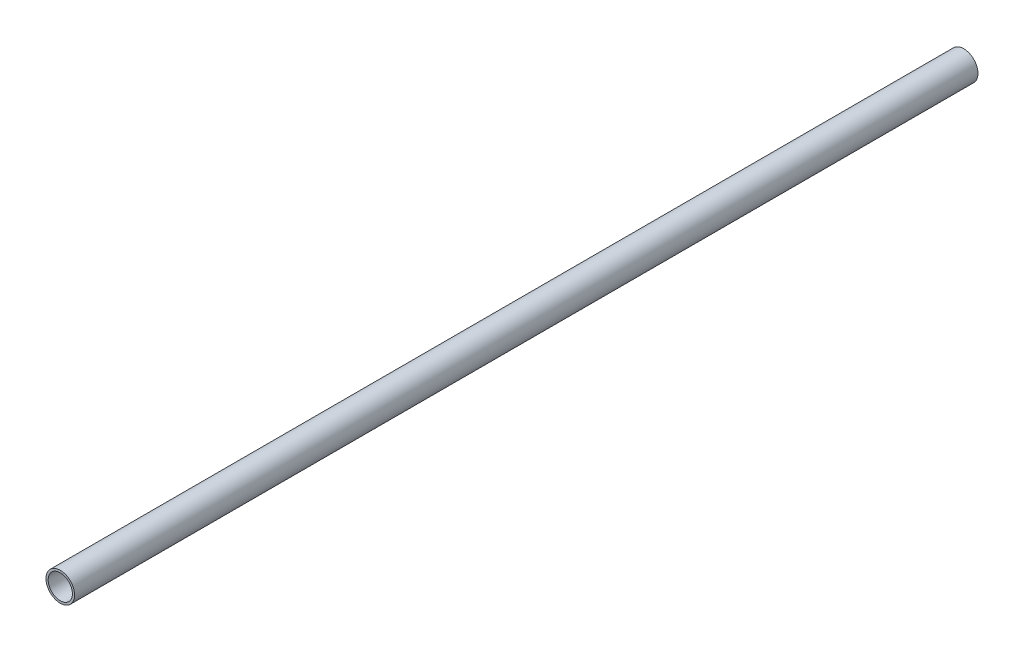
ISO-10303-21;
HEADER;
FILE_DESCRIPTION(('STEP AP214'),'2;1');
FILE_NAME('part.step','',(''),(''),'','','');
FILE_SCHEMA(('AUTOMOTIVE_DESIGN { 1 0 10303 214 1 1 1 1 }'));
ENDSEC;
DATA;
#1=APPLICATION_CONTEXT('core data for automotive mechanical design processes');
#2=APPLICATION_PROTOCOL_DEFINITION('international standard','automotive_design',2000,#1);
#3=PRODUCT_CONTEXT('',#1,'mechanical');
#4=PRODUCT('Part','Part','',(#3));
#5=PRODUCT_RELATED_PRODUCT_CATEGORY('part','',(#4));
#6=PRODUCT_DEFINITION_FORMATION('','',#4);
#7=PRODUCT_DEFINITION_CONTEXT('part definition',#1,'design');
#8=PRODUCT_DEFINITION('design','',#6,#7);
#9=PRODUCT_DEFINITION_SHAPE('','',#8);
#10=(LENGTH_UNIT() NAMED_UNIT(*) SI_UNIT(.MILLI.,.METRE.));
#11=(NAMED_UNIT(*) PLANE_ANGLE_UNIT() SI_UNIT($,.RADIAN.));
#12=(NAMED_UNIT(*) SI_UNIT($,.STERADIAN.) SOLID_ANGLE_UNIT());
#13=UNCERTAINTY_MEASURE_WITH_UNIT(LENGTH_MEASURE(1.E-05),#10,'distance_accuracy_value','');
#14=(GEOMETRIC_REPRESENTATION_CONTEXT(3) GLOBAL_UNCERTAINTY_ASSIGNED_CONTEXT((#13)) GLOBAL_UNIT_ASSIGNED_CONTEXT((#10,
#11,#12)) REPRESENTATION_CONTEXT('',''));
#15=CARTESIAN_POINT('',(0.,0.,0.));
#16=DIRECTION('',(0.,0.,1.));
#17=DIRECTION('',(1.,0.,0.));
#18=AXIS2_PLACEMENT_3D('',#15,#16,#17);
#19=CARTESIAN_POINT('',(0.,0.,762.));
#20=DIRECTION('',(0.,0.,1.));
#21=DIRECTION('',(1.,0.,0.));
#22=AXIS2_PLACEMENT_3D('',#19,#20,#21);
#23=PLANE('',#22);
#24=CARTESIAN_POINT('',(0.,0.,762.));
#25=DIRECTION('',(0.,0.,1.));
#26=DIRECTION('',(1.,0.,0.));
#27=AXIS2_PLACEMENT_3D('',#24,#25,#26);
#28=CIRCLE('',#27,24.1299999999999);
#29=CARTESIAN_POINT('',(24.1299999999999,0.,762.));
#30=VERTEX_POINT('',#29);
#31=EDGE_CURVE('E11',#30,#30,#28,.T.);
#32=ORIENTED_EDGE('',*,*,#31,.T.);
#33=EDGE_LOOP('',(#32));
#34=FACE_BOUND('',#33,.T.);
#35=CARTESIAN_POINT('',(0.,0.,762.));
#36=DIRECTION('',(0.,0.,1.));
#37=DIRECTION('',(1.,0.,0.));
#38=AXIS2_PLACEMENT_3D('',#35,#36,#37);
#39=CIRCLE('',#38,20.4469999999999);
#40=CARTESIAN_POINT('',(20.4469999999999,0.,762.));
#41=VERTEX_POINT('',#40);
#42=EDGE_CURVE('E54',#41,#41,#39,.T.);
#43=ORIENTED_EDGE('',*,*,#42,.F.);
#44=EDGE_LOOP('',(#43));
#45=FACE_BOUND('',#44,.T.);
#46=ADVANCED_FACE('F43',(#34,#45),#23,.T.);
#47=CARTESIAN_POINT('',(0.,0.,-762.));
#48=DIRECTION('',(0.,0.,1.));
#49=DIRECTION('',(1.,0.,0.));
#50=AXIS2_PLACEMENT_3D('',#47,#48,#49);
#51=PLANE('',#50);
#52=CARTESIAN_POINT('',(0.,0.,-762.));
#53=DIRECTION('',(0.,0.,1.));
#54=DIRECTION('',(1.,0.,0.));
#55=AXIS2_PLACEMENT_3D('',#52,#53,#54);
#56=CIRCLE('',#55,24.1299999999999);
#57=CARTESIAN_POINT('',(24.1299999999999,0.,-762.));
#58=VERTEX_POINT('',#57);
#59=EDGE_CURVE('E47',#58,#58,#56,.T.);
#60=ORIENTED_EDGE('',*,*,#59,.F.);
#61=EDGE_LOOP('',(#60));
#62=FACE_BOUND('',#61,.T.);
#63=CARTESIAN_POINT('',(0.,0.,-762.));
#64=DIRECTION('',(0.,0.,1.));
#65=DIRECTION('',(1.,0.,0.));
#66=AXIS2_PLACEMENT_3D('',#63,#64,#65);
#67=CIRCLE('',#66,20.4469999999999);
#68=CARTESIAN_POINT('',(20.4469999999999,0.,-762.));
#69=VERTEX_POINT('',#68);
#70=EDGE_CURVE('E56',#69,#69,#67,.T.);
#71=ORIENTED_EDGE('',*,*,#70,.T.);
#72=EDGE_LOOP('',(#71));
#73=FACE_BOUND('',#72,.T.);
#74=ADVANCED_FACE('F66',(#62,#73),#51,.F.);
#75=CARTESIAN_POINT('',(0.,0.,762.));
#76=DIRECTION('',(0.,0.,-1.));
#77=DIRECTION('',(-1.,0.,0.));
#78=AXIS2_PLACEMENT_3D('',#75,#76,#77);
#79=CYLINDRICAL_SURFACE('',#78,24.1299999999999);
#80=ORIENTED_EDGE('',*,*,#31,.F.);
#81=EDGE_LOOP('',(#80));
#82=FACE_BOUND('',#81,.T.);
#83=ORIENTED_EDGE('',*,*,#59,.T.);
#84=EDGE_LOOP('',(#83));
#85=FACE_BOUND('',#84,.T.);
#86=ADVANCED_FACE('F45',(#82,#85),#79,.T.);
#87=CARTESIAN_POINT('',(0.,0.,762.));
#88=DIRECTION('',(0.,0.,-1.));
#89=DIRECTION('',(-1.,0.,0.));
#90=AXIS2_PLACEMENT_3D('',#87,#88,#89);
#91=CYLINDRICAL_SURFACE('',#90,20.4469999999999);
#92=ORIENTED_EDGE('',*,*,#42,.T.);
#93=EDGE_LOOP('',(#92));
#94=FACE_BOUND('',#93,.T.);
#95=ORIENTED_EDGE('',*,*,#70,.F.);
#96=EDGE_LOOP('',(#95));
#97=FACE_BOUND('',#96,.T.);
#98=ADVANCED_FACE('F62',(#94,#97),#91,.F.);
#99=CLOSED_SHELL('',(#46,#74,#86,#98));
#100=MANIFOLD_SOLID_BREP('B2',#99);
#101=ADVANCED_BREP_SHAPE_REPRESENTATION('',(#18,#100),#14);
#102=SHAPE_DEFINITION_REPRESENTATION(#9,#101);
ENDSEC;
END-ISO-10303-21;
